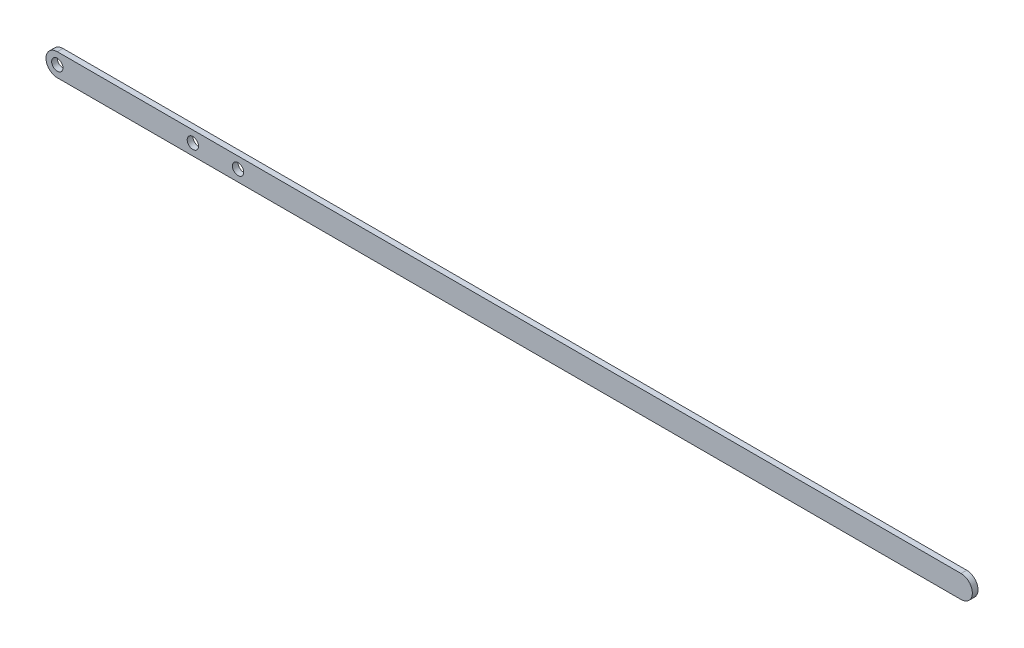
ISO-10303-21;
HEADER;
FILE_DESCRIPTION(('STEP AP214'),'2;1');
FILE_NAME('part.step','',(''),(''),'','','');
FILE_SCHEMA(('AUTOMOTIVE_DESIGN { 1 0 10303 214 1 1 1 1 }'));
ENDSEC;
DATA;
#1=APPLICATION_CONTEXT('core data for automotive mechanical design processes');
#2=APPLICATION_PROTOCOL_DEFINITION('international standard','automotive_design',2000,#1);
#3=PRODUCT_CONTEXT('',#1,'mechanical');
#4=PRODUCT('Part','Part','',(#3));
#5=PRODUCT_RELATED_PRODUCT_CATEGORY('part','',(#4));
#6=PRODUCT_DEFINITION_FORMATION('','',#4);
#7=PRODUCT_DEFINITION_CONTEXT('part definition',#1,'design');
#8=PRODUCT_DEFINITION('design','',#6,#7);
#9=PRODUCT_DEFINITION_SHAPE('','',#8);
#10=(LENGTH_UNIT() NAMED_UNIT(*) SI_UNIT(.MILLI.,.METRE.));
#11=(NAMED_UNIT(*) PLANE_ANGLE_UNIT() SI_UNIT($,.RADIAN.));
#12=(NAMED_UNIT(*) SI_UNIT($,.STERADIAN.) SOLID_ANGLE_UNIT());
#13=UNCERTAINTY_MEASURE_WITH_UNIT(LENGTH_MEASURE(1.E-05),#10,'distance_accuracy_value','');
#14=(GEOMETRIC_REPRESENTATION_CONTEXT(3) GLOBAL_UNCERTAINTY_ASSIGNED_CONTEXT((#13)) GLOBAL_UNIT_ASSIGNED_CONTEXT((#10,
#11,#12)) REPRESENTATION_CONTEXT('',''));
#15=CARTESIAN_POINT('',(0.,0.,0.));
#16=DIRECTION('',(0.,0.,1.));
#17=DIRECTION('',(1.,0.,0.));
#18=AXIS2_PLACEMENT_3D('',#15,#16,#17);
#19=CARTESIAN_POINT('',(-254.,0.,3.175));
#20=DIRECTION('',(0.,0.,1.));
#21=DIRECTION('',(1.,0.,0.));
#22=AXIS2_PLACEMENT_3D('',#19,#20,#21);
#23=PLANE('',#22);
#24=CARTESIAN_POINT('',(-177.8,0.,3.175));
#25=DIRECTION('',(0.,0.,1.));
#26=DIRECTION('',(1.,0.,0.));
#27=AXIS2_PLACEMENT_3D('',#24,#25,#26);
#28=CIRCLE('',#27,3.175);
#29=CARTESIAN_POINT('',(-174.625,0.,3.175));
#30=VERTEX_POINT('',#29);
#31=EDGE_CURVE('E115',#30,#30,#28,.T.);
#32=ORIENTED_EDGE('',*,*,#31,.F.);
#33=EDGE_LOOP('',(#32));
#34=FACE_BOUND('',#33,.T.);
#35=CARTESIAN_POINT('',(-254.,0.,3.175));
#36=DIRECTION('',(0.,0.,1.));
#37=DIRECTION('',(1.,0.,0.));
#38=AXIS2_PLACEMENT_3D('',#35,#36,#37);
#39=CIRCLE('',#38,6.35);
#40=CARTESIAN_POINT('',(-254.,6.34999999999998,3.175));
#41=VERTEX_POINT('',#40);
#42=CARTESIAN_POINT('',(-254.,-6.35000000000002,3.175));
#43=VERTEX_POINT('',#42);
#44=EDGE_CURVE('E85',#41,#43,#39,.T.);
#45=ORIENTED_EDGE('',*,*,#44,.T.);
#46=DIRECTION('',(1.,0.,0.));
#47=VECTOR('',#46,1.);
#48=CARTESIAN_POINT('',(-254.,-6.35000000000002,3.175));
#49=LINE('',#48,#47);
#50=CARTESIAN_POINT('',(254.,-6.35000000000002,3.175));
#51=VERTEX_POINT('',#50);
#52=EDGE_CURVE('E80',#43,#51,#49,.T.);
#53=ORIENTED_EDGE('',*,*,#52,.T.);
#54=CARTESIAN_POINT('',(254.,0.,3.175));
#55=DIRECTION('',(0.,0.,1.));
#56=DIRECTION('',(1.,0.,0.));
#57=AXIS2_PLACEMENT_3D('',#54,#55,#56);
#58=CIRCLE('',#57,6.35);
#59=CARTESIAN_POINT('',(254.,6.34999999999998,3.175));
#60=VERTEX_POINT('',#59);
#61=EDGE_CURVE('E83',#51,#60,#58,.T.);
#62=ORIENTED_EDGE('',*,*,#61,.T.);
#63=DIRECTION('',(-1.,0.,0.));
#64=VECTOR('',#63,1.);
#65=CARTESIAN_POINT('',(-254.,6.34999999999998,3.175));
#66=LINE('',#65,#64);
#67=EDGE_CURVE('E50',#60,#41,#66,.T.);
#68=ORIENTED_EDGE('',*,*,#67,.T.);
#69=EDGE_LOOP('',(#45,#53,#62,#68));
#70=FACE_BOUND('',#69,.T.);
#71=CARTESIAN_POINT('',(-254.,0.,3.175));
#72=DIRECTION('',(0.,0.,1.));
#73=DIRECTION('',(1.,0.,0.));
#74=AXIS2_PLACEMENT_3D('',#71,#72,#73);
#75=CIRCLE('',#74,3.17499999999997);
#76=CARTESIAN_POINT('',(-250.825,0.,3.175));
#77=VERTEX_POINT('',#76);
#78=EDGE_CURVE('E100',#77,#77,#75,.T.);
#79=ORIENTED_EDGE('',*,*,#78,.F.);
#80=EDGE_LOOP('',(#79));
#81=FACE_BOUND('',#80,.T.);
#82=CARTESIAN_POINT('',(-152.4,0.,3.175));
#83=DIRECTION('',(0.,0.,1.));
#84=DIRECTION('',(1.,0.,0.));
#85=AXIS2_PLACEMENT_3D('',#82,#83,#84);
#86=CIRCLE('',#85,3.175);
#87=CARTESIAN_POINT('',(-149.225,0.,3.175));
#88=VERTEX_POINT('',#87);
#89=EDGE_CURVE('E121',#88,#88,#86,.T.);
#90=ORIENTED_EDGE('',*,*,#89,.F.);
#91=EDGE_LOOP('',(#90));
#92=FACE_BOUND('',#91,.T.);
#93=ADVANCED_FACE('F33',(#34,#70,#81,#92),#23,.T.);
#94=CARTESIAN_POINT('',(-254.,0.,0.));
#95=DIRECTION('',(0.,0.,1.));
#96=DIRECTION('',(1.,0.,0.));
#97=AXIS2_PLACEMENT_3D('',#94,#95,#96);
#98=PLANE('',#97);
#99=CARTESIAN_POINT('',(-254.,0.,0.));
#100=DIRECTION('',(0.,0.,1.));
#101=DIRECTION('',(1.,0.,0.));
#102=AXIS2_PLACEMENT_3D('',#99,#100,#101);
#103=CIRCLE('',#102,6.35);
#104=CARTESIAN_POINT('',(-254.,6.34999999999998,0.));
#105=VERTEX_POINT('',#104);
#106=CARTESIAN_POINT('',(-254.,-6.35000000000002,0.));
#107=VERTEX_POINT('',#106);
#108=EDGE_CURVE('E97',#105,#107,#103,.T.);
#109=ORIENTED_EDGE('',*,*,#108,.F.);
#110=DIRECTION('',(-1.,0.,0.));
#111=VECTOR('',#110,1.);
#112=CARTESIAN_POINT('',(-254.,6.34999999999998,0.));
#113=LINE('',#112,#111);
#114=CARTESIAN_POINT('',(254.,6.34999999999998,0.));
#115=VERTEX_POINT('',#114);
#116=EDGE_CURVE('E73',#115,#105,#113,.T.);
#117=ORIENTED_EDGE('',*,*,#116,.F.);
#118=CARTESIAN_POINT('',(254.,0.,0.));
#119=DIRECTION('',(0.,0.,1.));
#120=DIRECTION('',(1.,0.,0.));
#121=AXIS2_PLACEMENT_3D('',#118,#119,#120);
#122=CIRCLE('',#121,6.35);
#123=CARTESIAN_POINT('',(254.,-6.35000000000002,0.));
#124=VERTEX_POINT('',#123);
#125=EDGE_CURVE('E67',#124,#115,#122,.T.);
#126=ORIENTED_EDGE('',*,*,#125,.F.);
#127=DIRECTION('',(1.,0.,0.));
#128=VECTOR('',#127,1.);
#129=CARTESIAN_POINT('',(-254.,-6.35000000000002,0.));
#130=LINE('',#129,#128);
#131=EDGE_CURVE('E89',#107,#124,#130,.T.);
#132=ORIENTED_EDGE('',*,*,#131,.F.);
#133=EDGE_LOOP('',(#109,#117,#126,#132));
#134=FACE_BOUND('',#133,.T.);
#135=CARTESIAN_POINT('',(-254.,0.,0.));
#136=DIRECTION('',(0.,0.,1.));
#137=DIRECTION('',(1.,0.,0.));
#138=AXIS2_PLACEMENT_3D('',#135,#136,#137);
#139=CIRCLE('',#138,3.17499999999997);
#140=CARTESIAN_POINT('',(-250.825,0.,0.));
#141=VERTEX_POINT('',#140);
#142=EDGE_CURVE('E112',#141,#141,#139,.T.);
#143=ORIENTED_EDGE('',*,*,#142,.T.);
#144=EDGE_LOOP('',(#143));
#145=FACE_BOUND('',#144,.T.);
#146=CARTESIAN_POINT('',(-177.8,0.,0.));
#147=DIRECTION('',(0.,0.,1.));
#148=DIRECTION('',(1.,0.,0.));
#149=AXIS2_PLACEMENT_3D('',#146,#147,#148);
#150=CIRCLE('',#149,3.175);
#151=CARTESIAN_POINT('',(-174.625,0.,0.));
#152=VERTEX_POINT('',#151);
#153=EDGE_CURVE('E118',#152,#152,#150,.T.);
#154=ORIENTED_EDGE('',*,*,#153,.T.);
#155=EDGE_LOOP('',(#154));
#156=FACE_BOUND('',#155,.T.);
#157=CARTESIAN_POINT('',(-152.4,0.,0.));
#158=DIRECTION('',(0.,0.,1.));
#159=DIRECTION('',(1.,0.,0.));
#160=AXIS2_PLACEMENT_3D('',#157,#158,#159);
#161=CIRCLE('',#160,3.175);
#162=CARTESIAN_POINT('',(-149.225,0.,0.));
#163=VERTEX_POINT('',#162);
#164=EDGE_CURVE('E124',#163,#163,#161,.T.);
#165=ORIENTED_EDGE('',*,*,#164,.T.);
#166=EDGE_LOOP('',(#165));
#167=FACE_BOUND('',#166,.T.);
#168=ADVANCED_FACE('F108',(#134,#145,#156,#167),#98,.F.);
#169=CARTESIAN_POINT('',(-254.,0.,3.175));
#170=DIRECTION('',(0.,0.,-1.));
#171=DIRECTION('',(-1.,0.,0.));
#172=AXIS2_PLACEMENT_3D('',#169,#170,#171);
#173=CYLINDRICAL_SURFACE('',#172,6.35);
#174=ORIENTED_EDGE('',*,*,#108,.T.);
#175=DIRECTION('',(0.,0.,-1.));
#176=VECTOR('',#175,1.);
#177=CARTESIAN_POINT('',(-254.,-6.35000000000002,3.175));
#178=LINE('',#177,#176);
#179=EDGE_CURVE('E11',#43,#107,#178,.T.);
#180=ORIENTED_EDGE('',*,*,#179,.F.);
#181=ORIENTED_EDGE('',*,*,#44,.F.);
#182=DIRECTION('',(0.,0.,-1.));
#183=VECTOR('',#182,1.);
#184=CARTESIAN_POINT('',(-254.,6.34999999999998,3.175));
#185=LINE('',#184,#183);
#186=EDGE_CURVE('E93',#41,#105,#185,.T.);
#187=ORIENTED_EDGE('',*,*,#186,.T.);
#188=EDGE_LOOP('',(#174,#180,#181,#187));
#189=FACE_BOUND('',#188,.T.);
#190=ADVANCED_FACE('F35',(#189),#173,.T.);
#191=CARTESIAN_POINT('',(-254.,-6.35000000000002,3.175));
#192=DIRECTION('',(0.,1.,0.));
#193=DIRECTION('',(0.,0.,1.));
#194=AXIS2_PLACEMENT_3D('',#191,#192,#193);
#195=PLANE('',#194);
#196=ORIENTED_EDGE('',*,*,#131,.T.);
#197=DIRECTION('',(0.,0.,-1.));
#198=VECTOR('',#197,1.);
#199=CARTESIAN_POINT('',(254.,-6.35000000000002,3.175));
#200=LINE('',#199,#198);
#201=EDGE_CURVE('E42',#51,#124,#200,.T.);
#202=ORIENTED_EDGE('',*,*,#201,.F.);
#203=ORIENTED_EDGE('',*,*,#52,.F.);
#204=ORIENTED_EDGE('',*,*,#179,.T.);
#205=EDGE_LOOP('',(#196,#202,#203,#204));
#206=FACE_BOUND('',#205,.T.);
#207=ADVANCED_FACE('F88',(#206),#195,.F.);
#208=CARTESIAN_POINT('',(254.,0.,3.175));
#209=DIRECTION('',(0.,0.,-1.));
#210=DIRECTION('',(-1.,0.,0.));
#211=AXIS2_PLACEMENT_3D('',#208,#209,#210);
#212=CYLINDRICAL_SURFACE('',#211,6.35);
#213=ORIENTED_EDGE('',*,*,#125,.T.);
#214=DIRECTION('',(0.,0.,-1.));
#215=VECTOR('',#214,1.);
#216=CARTESIAN_POINT('',(254.,6.34999999999998,3.175));
#217=LINE('',#216,#215);
#218=EDGE_CURVE('E90',#60,#115,#217,.T.);
#219=ORIENTED_EDGE('',*,*,#218,.F.);
#220=ORIENTED_EDGE('',*,*,#61,.F.);
#221=ORIENTED_EDGE('',*,*,#201,.T.);
#222=EDGE_LOOP('',(#213,#219,#220,#221));
#223=FACE_BOUND('',#222,.T.);
#224=ADVANCED_FACE('F91',(#223),#212,.T.);
#225=CARTESIAN_POINT('',(-254.,6.34999999999998,3.175));
#226=DIRECTION('',(0.,-1.,0.));
#227=DIRECTION('',(0.,0.,-1.));
#228=AXIS2_PLACEMENT_3D('',#225,#226,#227);
#229=PLANE('',#228);
#230=ORIENTED_EDGE('',*,*,#116,.T.);
#231=ORIENTED_EDGE('',*,*,#186,.F.);
#232=ORIENTED_EDGE('',*,*,#67,.F.);
#233=ORIENTED_EDGE('',*,*,#218,.T.);
#234=EDGE_LOOP('',(#230,#231,#232,#233));
#235=FACE_BOUND('',#234,.T.);
#236=ADVANCED_FACE('F105',(#235),#229,.F.);
#237=CARTESIAN_POINT('',(-254.,0.,3.175));
#238=DIRECTION('',(0.,0.,-1.));
#239=DIRECTION('',(-1.,0.,0.));
#240=AXIS2_PLACEMENT_3D('',#237,#238,#239);
#241=CYLINDRICAL_SURFACE('',#240,3.17499999999997);
#242=ORIENTED_EDGE('',*,*,#78,.T.);
#243=EDGE_LOOP('',(#242));
#244=FACE_BOUND('',#243,.T.);
#245=ORIENTED_EDGE('',*,*,#142,.F.);
#246=EDGE_LOOP('',(#245));
#247=FACE_BOUND('',#246,.T.);
#248=ADVANCED_FACE('F142',(#244,#247),#241,.F.);
#249=CARTESIAN_POINT('',(-177.8,0.,3.175));
#250=DIRECTION('',(0.,0.,-1.));
#251=DIRECTION('',(-1.,0.,0.));
#252=AXIS2_PLACEMENT_3D('',#249,#250,#251);
#253=CYLINDRICAL_SURFACE('',#252,3.175);
#254=ORIENTED_EDGE('',*,*,#31,.T.);
#255=EDGE_LOOP('',(#254));
#256=FACE_BOUND('',#255,.T.);
#257=ORIENTED_EDGE('',*,*,#153,.F.);
#258=EDGE_LOOP('',(#257));
#259=FACE_BOUND('',#258,.T.);
#260=ADVANCED_FACE('F188',(#256,#259),#253,.F.);
#261=CARTESIAN_POINT('',(-152.4,0.,3.175));
#262=DIRECTION('',(0.,0.,-1.));
#263=DIRECTION('',(-1.,0.,0.));
#264=AXIS2_PLACEMENT_3D('',#261,#262,#263);
#265=CYLINDRICAL_SURFACE('',#264,3.175);
#266=ORIENTED_EDGE('',*,*,#89,.T.);
#267=EDGE_LOOP('',(#266));
#268=FACE_BOUND('',#267,.T.);
#269=ORIENTED_EDGE('',*,*,#164,.F.);
#270=EDGE_LOOP('',(#269));
#271=FACE_BOUND('',#270,.T.);
#272=ADVANCED_FACE('F130',(#268,#271),#265,.F.);
#273=CLOSED_SHELL('',(#93,#168,#190,#207,#224,#236,#248,#260,#272));
#274=MANIFOLD_SOLID_BREP('B2',#273);
#275=ADVANCED_BREP_SHAPE_REPRESENTATION('',(#18,#274),#14);
#276=SHAPE_DEFINITION_REPRESENTATION(#9,#275);
ENDSEC;
END-ISO-10303-21;
